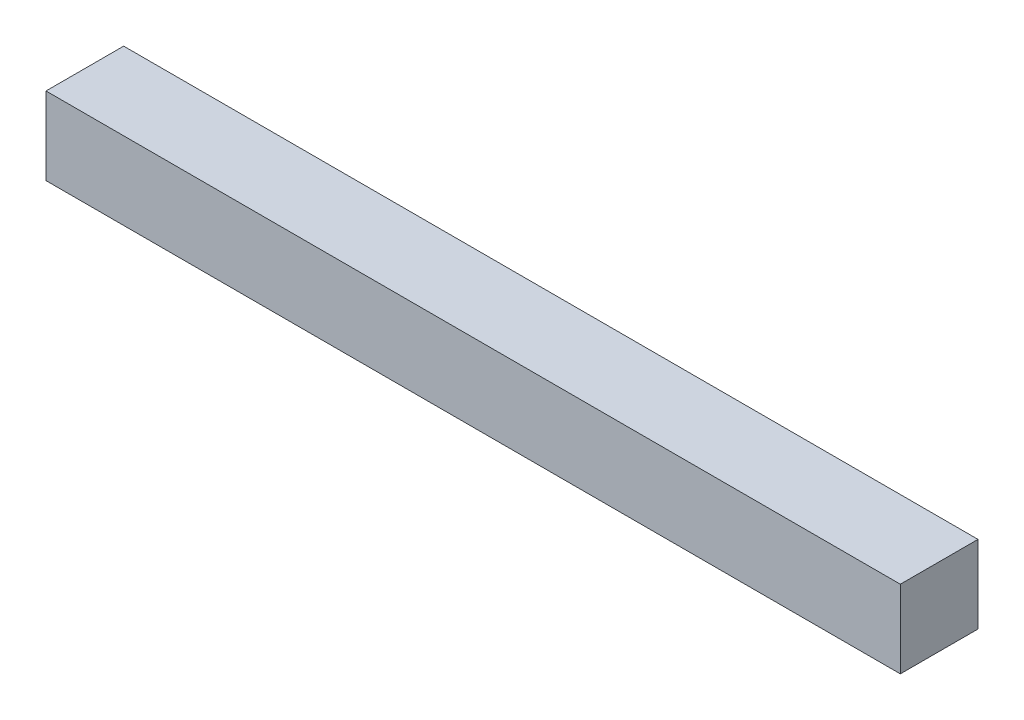
ISO-10303-21;
HEADER;
FILE_DESCRIPTION(('STEP AP214'),'2;1');
FILE_NAME('part.step','',(''),(''),'','','');
FILE_SCHEMA(('AUTOMOTIVE_DESIGN { 1 0 10303 214 1 1 1 1 }'));
ENDSEC;
DATA;
#1=APPLICATION_CONTEXT('core data for automotive mechanical design processes');
#2=APPLICATION_PROTOCOL_DEFINITION('international standard','automotive_design',2000,#1);
#3=PRODUCT_CONTEXT('',#1,'mechanical');
#4=PRODUCT('Part','Part','',(#3));
#5=PRODUCT_RELATED_PRODUCT_CATEGORY('part','',(#4));
#6=PRODUCT_DEFINITION_FORMATION('','',#4);
#7=PRODUCT_DEFINITION_CONTEXT('part definition',#1,'design');
#8=PRODUCT_DEFINITION('design','',#6,#7);
#9=PRODUCT_DEFINITION_SHAPE('','',#8);
#10=(LENGTH_UNIT() NAMED_UNIT(*) SI_UNIT(.MILLI.,.METRE.));
#11=(NAMED_UNIT(*) PLANE_ANGLE_UNIT() SI_UNIT($,.RADIAN.));
#12=(NAMED_UNIT(*) SI_UNIT($,.STERADIAN.) SOLID_ANGLE_UNIT());
#13=UNCERTAINTY_MEASURE_WITH_UNIT(LENGTH_MEASURE(1.E-05),#10,'distance_accuracy_value','');
#14=(GEOMETRIC_REPRESENTATION_CONTEXT(3) GLOBAL_UNCERTAINTY_ASSIGNED_CONTEXT((#13)) GLOBAL_UNIT_ASSIGNED_CONTEXT((#10,
#11,#12)) REPRESENTATION_CONTEXT('',''));
#15=CARTESIAN_POINT('',(0.,0.,0.));
#16=DIRECTION('',(0.,0.,1.));
#17=DIRECTION('',(1.,0.,0.));
#18=AXIS2_PLACEMENT_3D('',#15,#16,#17);
#19=CARTESIAN_POINT('',(139.7,25.4,12.7));
#20=DIRECTION('',(-1.,0.,0.));
#21=DIRECTION('',(0.,0.,1.));
#22=AXIS2_PLACEMENT_3D('',#19,#20,#21);
#23=PLANE('',#22);
#24=DIRECTION('',(0.,0.,-1.));
#25=VECTOR('',#24,1.);
#26=CARTESIAN_POINT('',(139.7,0.,12.7));
#27=LINE('',#26,#25);
#28=CARTESIAN_POINT('',(139.7,0.,12.7));
#29=VERTEX_POINT('',#28);
#30=CARTESIAN_POINT('',(139.7,0.,-12.7));
#31=VERTEX_POINT('',#30);
#32=EDGE_CURVE('E107',#29,#31,#27,.T.);
#33=ORIENTED_EDGE('',*,*,#32,.T.);
#34=DIRECTION('',(0.,-1.,0.));
#35=VECTOR('',#34,1.);
#36=CARTESIAN_POINT('',(139.7,25.4,-12.7));
#37=LINE('',#36,#35);
#38=CARTESIAN_POINT('',(139.7,25.4,-12.7));
#39=VERTEX_POINT('',#38);
#40=EDGE_CURVE('E11',#39,#31,#37,.T.);
#41=ORIENTED_EDGE('',*,*,#40,.F.);
#42=DIRECTION('',(0.,0.,-1.));
#43=VECTOR('',#42,1.);
#44=CARTESIAN_POINT('',(139.7,25.4,12.7));
#45=LINE('',#44,#43);
#46=CARTESIAN_POINT('',(139.7,25.4,12.7));
#47=VERTEX_POINT('',#46);
#48=EDGE_CURVE('E91',#47,#39,#45,.T.);
#49=ORIENTED_EDGE('',*,*,#48,.F.);
#50=DIRECTION('',(0.,-1.,0.));
#51=VECTOR('',#50,1.);
#52=CARTESIAN_POINT('',(139.7,25.4,12.7));
#53=LINE('',#52,#51);
#54=EDGE_CURVE('E103',#47,#29,#53,.T.);
#55=ORIENTED_EDGE('',*,*,#54,.T.);
#56=EDGE_LOOP('',(#33,#41,#49,#55));
#57=FACE_BOUND('',#56,.T.);
#58=ADVANCED_FACE('F39',(#57),#23,.F.);
#59=CARTESIAN_POINT('',(-139.7,25.4,-12.7));
#60=DIRECTION('',(0.,0.,1.));
#61=DIRECTION('',(1.,0.,0.));
#62=AXIS2_PLACEMENT_3D('',#59,#60,#61);
#63=PLANE('',#62);
#64=DIRECTION('',(-1.,0.,0.));
#65=VECTOR('',#64,1.);
#66=CARTESIAN_POINT('',(-139.7,0.,-12.7));
#67=LINE('',#66,#65);
#68=CARTESIAN_POINT('',(-139.7,0.,-12.7));
#69=VERTEX_POINT('',#68);
#70=EDGE_CURVE('E96',#31,#69,#67,.T.);
#71=ORIENTED_EDGE('',*,*,#70,.T.);
#72=DIRECTION('',(0.,-1.,0.));
#73=VECTOR('',#72,1.);
#74=CARTESIAN_POINT('',(-139.7,25.4,-12.7));
#75=LINE('',#74,#73);
#76=CARTESIAN_POINT('',(-139.7,25.4,-12.7));
#77=VERTEX_POINT('',#76);
#78=EDGE_CURVE('E48',#77,#69,#75,.T.);
#79=ORIENTED_EDGE('',*,*,#78,.F.);
#80=DIRECTION('',(-1.,0.,0.));
#81=VECTOR('',#80,1.);
#82=CARTESIAN_POINT('',(-139.7,25.4,-12.7));
#83=LINE('',#82,#81);
#84=EDGE_CURVE('E86',#39,#77,#83,.T.);
#85=ORIENTED_EDGE('',*,*,#84,.F.);
#86=ORIENTED_EDGE('',*,*,#40,.T.);
#87=EDGE_LOOP('',(#71,#79,#85,#86));
#88=FACE_BOUND('',#87,.T.);
#89=ADVANCED_FACE('F95',(#88),#63,.F.);
#90=CARTESIAN_POINT('',(-139.7,25.4,12.7));
#91=DIRECTION('',(1.,0.,0.));
#92=DIRECTION('',(0.,0.,-1.));
#93=AXIS2_PLACEMENT_3D('',#90,#91,#92);
#94=PLANE('',#93);
#95=DIRECTION('',(0.,0.,1.));
#96=VECTOR('',#95,1.);
#97=CARTESIAN_POINT('',(-139.7,0.,12.7));
#98=LINE('',#97,#96);
#99=CARTESIAN_POINT('',(-139.7,0.,12.7));
#100=VERTEX_POINT('',#99);
#101=EDGE_CURVE('E73',#69,#100,#98,.T.);
#102=ORIENTED_EDGE('',*,*,#101,.T.);
#103=DIRECTION('',(0.,-1.,0.));
#104=VECTOR('',#103,1.);
#105=CARTESIAN_POINT('',(-139.7,25.4,12.7));
#106=LINE('',#105,#104);
#107=CARTESIAN_POINT('',(-139.7,25.4,12.7));
#108=VERTEX_POINT('',#107);
#109=EDGE_CURVE('E98',#108,#100,#106,.T.);
#110=ORIENTED_EDGE('',*,*,#109,.F.);
#111=DIRECTION('',(0.,0.,1.));
#112=VECTOR('',#111,1.);
#113=CARTESIAN_POINT('',(-139.7,25.4,12.7));
#114=LINE('',#113,#112);
#115=EDGE_CURVE('E89',#77,#108,#114,.T.);
#116=ORIENTED_EDGE('',*,*,#115,.F.);
#117=ORIENTED_EDGE('',*,*,#78,.T.);
#118=EDGE_LOOP('',(#102,#110,#116,#117));
#119=FACE_BOUND('',#118,.T.);
#120=ADVANCED_FACE('F99',(#119),#94,.F.);
#121=CARTESIAN_POINT('',(-139.7,25.4,12.7));
#122=DIRECTION('',(0.,0.,-1.));
#123=DIRECTION('',(-1.,0.,0.));
#124=AXIS2_PLACEMENT_3D('',#121,#122,#123);
#125=PLANE('',#124);
#126=DIRECTION('',(1.,0.,0.));
#127=VECTOR('',#126,1.);
#128=CARTESIAN_POINT('',(-139.7,0.,12.7));
#129=LINE('',#128,#127);
#130=EDGE_CURVE('E79',#100,#29,#129,.T.);
#131=ORIENTED_EDGE('',*,*,#130,.T.);
#132=ORIENTED_EDGE('',*,*,#54,.F.);
#133=DIRECTION('',(1.,0.,0.));
#134=VECTOR('',#133,1.);
#135=CARTESIAN_POINT('',(-139.7,25.4,12.7));
#136=LINE('',#135,#134);
#137=EDGE_CURVE('E56',#108,#47,#136,.T.);
#138=ORIENTED_EDGE('',*,*,#137,.F.);
#139=ORIENTED_EDGE('',*,*,#109,.T.);
#140=EDGE_LOOP('',(#131,#132,#138,#139));
#141=FACE_BOUND('',#140,.T.);
#142=ADVANCED_FACE('F120',(#141),#125,.F.);
#143=CARTESIAN_POINT('',(0.,25.4,0.));
#144=DIRECTION('',(0.,-1.,0.));
#145=DIRECTION('',(0.,0.,-1.));
#146=AXIS2_PLACEMENT_3D('',#143,#144,#145);
#147=PLANE('',#146);
#148=ORIENTED_EDGE('',*,*,#48,.T.);
#149=ORIENTED_EDGE('',*,*,#84,.T.);
#150=ORIENTED_EDGE('',*,*,#115,.T.);
#151=ORIENTED_EDGE('',*,*,#137,.T.);
#152=EDGE_LOOP('',(#148,#149,#150,#151));
#153=FACE_BOUND('',#152,.T.);
#154=ADVANCED_FACE('F87',(#153),#147,.F.);
#155=CARTESIAN_POINT('',(0.,0.,0.));
#156=DIRECTION('',(0.,-1.,0.));
#157=DIRECTION('',(0.,0.,-1.));
#158=AXIS2_PLACEMENT_3D('',#155,#156,#157);
#159=PLANE('',#158);
#160=ORIENTED_EDGE('',*,*,#32,.F.);
#161=ORIENTED_EDGE('',*,*,#130,.F.);
#162=ORIENTED_EDGE('',*,*,#101,.F.);
#163=ORIENTED_EDGE('',*,*,#70,.F.);
#164=EDGE_LOOP('',(#160,#161,#162,#163));
#165=FACE_BOUND('',#164,.T.);
#166=ADVANCED_FACE('F123',(#165),#159,.T.);
#167=CLOSED_SHELL('',(#58,#89,#120,#142,#154,#166));
#168=MANIFOLD_SOLID_BREP('B2',#167);
#169=ADVANCED_BREP_SHAPE_REPRESENTATION('',(#18,#168),#14);
#170=SHAPE_DEFINITION_REPRESENTATION(#9,#169);
ENDSEC;
END-ISO-10303-21;
